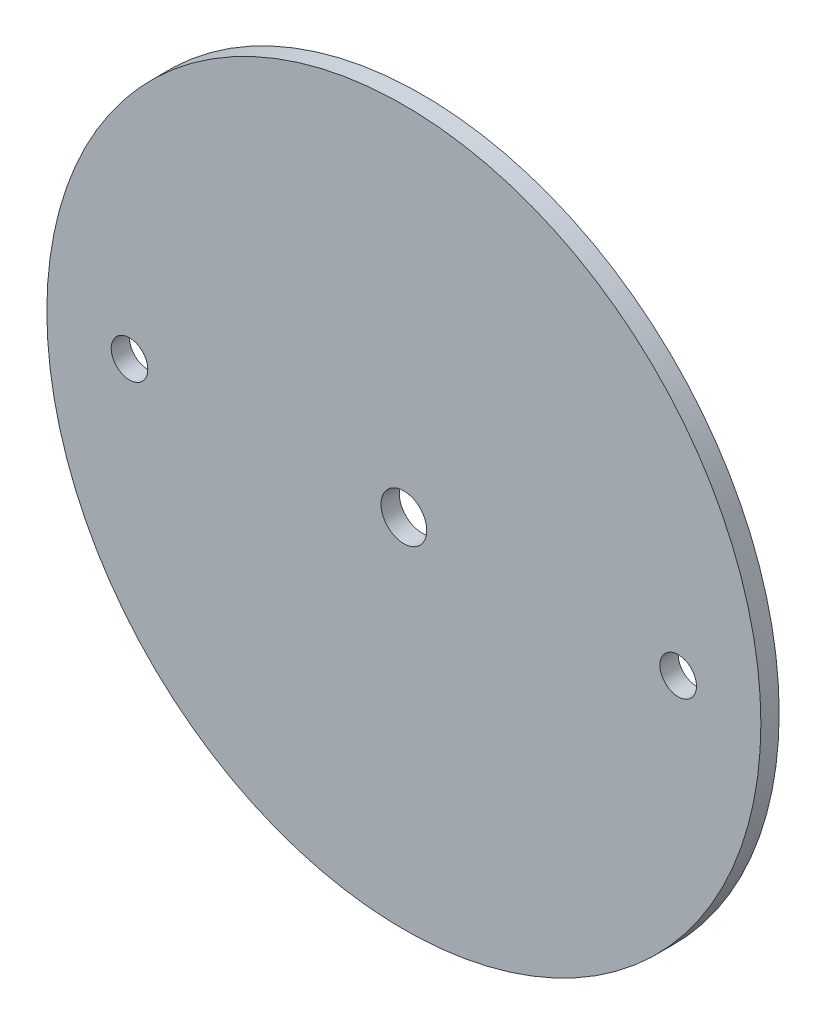
ISO-10303-21;
HEADER;
FILE_DESCRIPTION(('STEP AP214'),'2;1');
FILE_NAME('part.step','',(''),(''),'','','');
FILE_SCHEMA(('AUTOMOTIVE_DESIGN { 1 0 10303 214 1 1 1 1 }'));
ENDSEC;
DATA;
#1=APPLICATION_CONTEXT('core data for automotive mechanical design processes');
#2=APPLICATION_PROTOCOL_DEFINITION('international standard','automotive_design',2000,#1);
#3=PRODUCT_CONTEXT('',#1,'mechanical');
#4=PRODUCT('Part','Part','',(#3));
#5=PRODUCT_RELATED_PRODUCT_CATEGORY('part','',(#4));
#6=PRODUCT_DEFINITION_FORMATION('','',#4);
#7=PRODUCT_DEFINITION_CONTEXT('part definition',#1,'design');
#8=PRODUCT_DEFINITION('design','',#6,#7);
#9=PRODUCT_DEFINITION_SHAPE('','',#8);
#10=(LENGTH_UNIT() NAMED_UNIT(*) SI_UNIT(.MILLI.,.METRE.));
#11=(NAMED_UNIT(*) PLANE_ANGLE_UNIT() SI_UNIT($,.RADIAN.));
#12=(NAMED_UNIT(*) SI_UNIT($,.STERADIAN.) SOLID_ANGLE_UNIT());
#13=UNCERTAINTY_MEASURE_WITH_UNIT(LENGTH_MEASURE(1.E-05),#10,'distance_accuracy_value','');
#14=(GEOMETRIC_REPRESENTATION_CONTEXT(3) GLOBAL_UNCERTAINTY_ASSIGNED_CONTEXT((#13)) GLOBAL_UNIT_ASSIGNED_CONTEXT((#10,
#11,#12)) REPRESENTATION_CONTEXT('',''));
#15=CARTESIAN_POINT('',(0.,0.,0.));
#16=DIRECTION('',(0.,0.,1.));
#17=DIRECTION('',(1.,0.,0.));
#18=AXIS2_PLACEMENT_3D('',#15,#16,#17);
#19=CARTESIAN_POINT('',(0.,0.,1.5875));
#20=DIRECTION('',(0.,0.,-1.));
#21=DIRECTION('',(-1.,0.,0.));
#22=AXIS2_PLACEMENT_3D('',#19,#20,#21);
#23=CYLINDRICAL_SURFACE('',#22,61.976);
#24=CARTESIAN_POINT('',(0.,0.,1.5875));
#25=DIRECTION('',(0.,0.,1.));
#26=DIRECTION('',(1.,0.,0.));
#27=AXIS2_PLACEMENT_3D('',#24,#25,#26);
#28=CIRCLE('',#27,61.976);
#29=CARTESIAN_POINT('',(61.976,0.,1.5875));
#30=VERTEX_POINT('',#29);
#31=EDGE_CURVE('E10',#30,#30,#28,.T.);
#32=ORIENTED_EDGE('',*,*,#31,.F.);
#33=EDGE_LOOP('',(#32));
#34=FACE_BOUND('',#33,.T.);
#35=CARTESIAN_POINT('',(0.,0.,-1.5875));
#36=DIRECTION('',(0.,0.,1.));
#37=DIRECTION('',(1.,0.,0.));
#38=AXIS2_PLACEMENT_3D('',#35,#36,#37);
#39=CIRCLE('',#38,61.976);
#40=CARTESIAN_POINT('',(61.976,0.,-1.5875));
#41=VERTEX_POINT('',#40);
#42=EDGE_CURVE('E44',#41,#41,#39,.T.);
#43=ORIENTED_EDGE('',*,*,#42,.T.);
#44=EDGE_LOOP('',(#43));
#45=FACE_BOUND('',#44,.T.);
#46=ADVANCED_FACE('F37',(#34,#45),#23,.T.);
#47=CARTESIAN_POINT('',(0.,0.,1.5875));
#48=DIRECTION('',(0.,0.,1.));
#49=DIRECTION('',(1.,0.,0.));
#50=AXIS2_PLACEMENT_3D('',#47,#48,#49);
#51=PLANE('',#50);
#52=CARTESIAN_POINT('',(0.,0.,1.5875));
#53=DIRECTION('',(0.,0.,1.));
#54=DIRECTION('',(1.,0.,0.));
#55=AXIS2_PLACEMENT_3D('',#52,#53,#54);
#56=CIRCLE('',#55,3.96875);
#57=CARTESIAN_POINT('',(3.96875,0.,1.5875));
#58=VERTEX_POINT('',#57);
#59=EDGE_CURVE('E62',#58,#58,#56,.T.);
#60=ORIENTED_EDGE('',*,*,#59,.F.);
#61=EDGE_LOOP('',(#60));
#62=FACE_BOUND('',#61,.T.);
#63=CARTESIAN_POINT('',(47.625,0.,1.5875));
#64=DIRECTION('',(0.,0.,1.));
#65=DIRECTION('',(1.,0.,0.));
#66=AXIS2_PLACEMENT_3D('',#63,#64,#65);
#67=CIRCLE('',#66,3.17499999999998);
#68=CARTESIAN_POINT('',(50.8,0.,1.5875));
#69=VERTEX_POINT('',#68);
#70=EDGE_CURVE('E59',#69,#69,#67,.T.);
#71=ORIENTED_EDGE('',*,*,#70,.F.);
#72=EDGE_LOOP('',(#71));
#73=FACE_BOUND('',#72,.T.);
#74=CARTESIAN_POINT('',(-47.625,0.,1.5875));
#75=DIRECTION('',(0.,0.,1.));
#76=DIRECTION('',(1.,0.,0.));
#77=AXIS2_PLACEMENT_3D('',#74,#75,#76);
#78=CIRCLE('',#77,3.17499999999998);
#79=CARTESIAN_POINT('',(-44.45,0.,1.5875));
#80=VERTEX_POINT('',#79);
#81=EDGE_CURVE('E53',#80,#80,#78,.T.);
#82=ORIENTED_EDGE('',*,*,#81,.F.);
#83=EDGE_LOOP('',(#82));
#84=FACE_BOUND('',#83,.T.);
#85=ORIENTED_EDGE('',*,*,#31,.T.);
#86=EDGE_LOOP('',(#85));
#87=FACE_BOUND('',#86,.T.);
#88=ADVANCED_FACE('F84',(#62,#73,#84,#87),#51,.T.);
#89=CARTESIAN_POINT('',(0.,0.,-1.5875));
#90=DIRECTION('',(0.,0.,1.));
#91=DIRECTION('',(1.,0.,0.));
#92=AXIS2_PLACEMENT_3D('',#89,#90,#91);
#93=PLANE('',#92);
#94=CARTESIAN_POINT('',(0.,0.,-1.5875));
#95=DIRECTION('',(0.,0.,1.));
#96=DIRECTION('',(1.,0.,0.));
#97=AXIS2_PLACEMENT_3D('',#94,#95,#96);
#98=CIRCLE('',#97,3.96875);
#99=CARTESIAN_POINT('',(3.96875,0.,-1.5875));
#100=VERTEX_POINT('',#99);
#101=EDGE_CURVE('E40',#100,#100,#98,.T.);
#102=ORIENTED_EDGE('',*,*,#101,.T.);
#103=EDGE_LOOP('',(#102));
#104=FACE_BOUND('',#103,.T.);
#105=CARTESIAN_POINT('',(47.625,0.,-1.5875));
#106=DIRECTION('',(0.,0.,1.));
#107=DIRECTION('',(1.,0.,0.));
#108=AXIS2_PLACEMENT_3D('',#105,#106,#107);
#109=CIRCLE('',#108,3.175);
#110=CARTESIAN_POINT('',(50.8,0.,-1.5875));
#111=VERTEX_POINT('',#110);
#112=EDGE_CURVE('E56',#111,#111,#109,.T.);
#113=ORIENTED_EDGE('',*,*,#112,.T.);
#114=EDGE_LOOP('',(#113));
#115=FACE_BOUND('',#114,.T.);
#116=CARTESIAN_POINT('',(-47.625,0.,-1.5875));
#117=DIRECTION('',(0.,0.,1.));
#118=DIRECTION('',(1.,0.,0.));
#119=AXIS2_PLACEMENT_3D('',#116,#117,#118);
#120=CIRCLE('',#119,3.175);
#121=CARTESIAN_POINT('',(-44.45,0.,-1.5875));
#122=VERTEX_POINT('',#121);
#123=EDGE_CURVE('E49',#122,#122,#120,.T.);
#124=ORIENTED_EDGE('',*,*,#123,.T.);
#125=EDGE_LOOP('',(#124));
#126=FACE_BOUND('',#125,.T.);
#127=ORIENTED_EDGE('',*,*,#42,.F.);
#128=EDGE_LOOP('',(#127));
#129=FACE_BOUND('',#128,.T.);
#130=ADVANCED_FACE('F69',(#104,#115,#126,#129),#93,.F.);
#131=CARTESIAN_POINT('',(-47.625,0.,1.5875));
#132=DIRECTION('',(0.,0.,1.));
#133=DIRECTION('',(1.,0.,0.));
#134=AXIS2_PLACEMENT_3D('',#131,#132,#133);
#135=CYLINDRICAL_SURFACE('',#134,3.17499999999999);
#136=ORIENTED_EDGE('',*,*,#123,.F.);
#137=EDGE_LOOP('',(#136));
#138=FACE_BOUND('',#137,.T.);
#139=ORIENTED_EDGE('',*,*,#81,.T.);
#140=EDGE_LOOP('',(#139));
#141=FACE_BOUND('',#140,.T.);
#142=ADVANCED_FACE('F80',(#138,#141),#135,.F.);
#143=CARTESIAN_POINT('',(47.625,0.,1.5875));
#144=DIRECTION('',(0.,0.,1.));
#145=DIRECTION('',(1.,0.,0.));
#146=AXIS2_PLACEMENT_3D('',#143,#144,#145);
#147=CYLINDRICAL_SURFACE('',#146,3.17499999999999);
#148=ORIENTED_EDGE('',*,*,#112,.F.);
#149=EDGE_LOOP('',(#148));
#150=FACE_BOUND('',#149,.T.);
#151=ORIENTED_EDGE('',*,*,#70,.T.);
#152=EDGE_LOOP('',(#151));
#153=FACE_BOUND('',#152,.T.);
#154=ADVANCED_FACE('F74',(#150,#153),#147,.F.);
#155=CARTESIAN_POINT('',(0.,0.,1.5875));
#156=DIRECTION('',(0.,0.,1.));
#157=DIRECTION('',(1.,0.,0.));
#158=AXIS2_PLACEMENT_3D('',#155,#156,#157);
#159=CYLINDRICAL_SURFACE('',#158,3.96875);
#160=ORIENTED_EDGE('',*,*,#59,.T.);
#161=EDGE_LOOP('',(#160));
#162=FACE_BOUND('',#161,.T.);
#163=ORIENTED_EDGE('',*,*,#101,.F.);
#164=EDGE_LOOP('',(#163));
#165=FACE_BOUND('',#164,.T.);
#166=ADVANCED_FACE('F72',(#162,#165),#159,.F.);
#167=CLOSED_SHELL('',(#46,#88,#130,#142,#154,#166));
#168=MANIFOLD_SOLID_BREP('B2',#167);
#169=ADVANCED_BREP_SHAPE_REPRESENTATION('',(#18,#168),#14);
#170=SHAPE_DEFINITION_REPRESENTATION(#9,#169);
ENDSEC;
END-ISO-10303-21;
